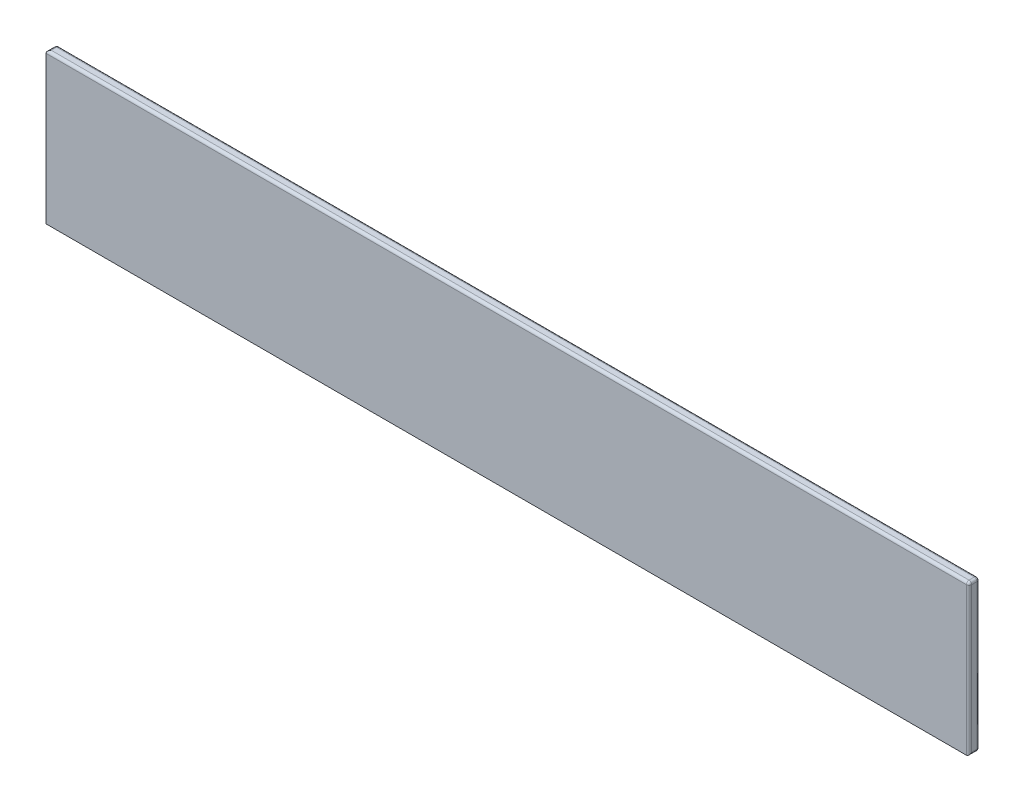
ISO-10303-21;
HEADER;
FILE_DESCRIPTION(('STEP AP214'),'2;1');
FILE_NAME('part.step','',(''),(''),'','','');
FILE_SCHEMA(('AUTOMOTIVE_DESIGN { 1 0 10303 214 1 1 1 1 }'));
ENDSEC;
DATA;
#1=APPLICATION_CONTEXT('core data for automotive mechanical design processes');
#2=APPLICATION_PROTOCOL_DEFINITION('international standard','automotive_design',2000,#1);
#3=PRODUCT_CONTEXT('',#1,'mechanical');
#4=PRODUCT('Part','Part','',(#3));
#5=PRODUCT_RELATED_PRODUCT_CATEGORY('part','',(#4));
#6=PRODUCT_DEFINITION_FORMATION('','',#4);
#7=PRODUCT_DEFINITION_CONTEXT('part definition',#1,'design');
#8=PRODUCT_DEFINITION('design','',#6,#7);
#9=PRODUCT_DEFINITION_SHAPE('','',#8);
#10=(LENGTH_UNIT() NAMED_UNIT(*) SI_UNIT(.MILLI.,.METRE.));
#11=(NAMED_UNIT(*) PLANE_ANGLE_UNIT() SI_UNIT($,.RADIAN.));
#12=(NAMED_UNIT(*) SI_UNIT($,.STERADIAN.) SOLID_ANGLE_UNIT());
#13=UNCERTAINTY_MEASURE_WITH_UNIT(LENGTH_MEASURE(1.E-05),#10,'distance_accuracy_value','');
#14=(GEOMETRIC_REPRESENTATION_CONTEXT(3) GLOBAL_UNCERTAINTY_ASSIGNED_CONTEXT((#13)) GLOBAL_UNIT_ASSIGNED_CONTEXT((#10,
#11,#12)) REPRESENTATION_CONTEXT('',''));
#15=CARTESIAN_POINT('',(0.,0.,0.));
#16=DIRECTION('',(0.,0.,1.));
#17=DIRECTION('',(1.,0.,0.));
#18=AXIS2_PLACEMENT_3D('',#15,#16,#17);
#19=CARTESIAN_POINT('',(875.,142.5,20.));
#20=DIRECTION('',(-1.,0.,0.));
#21=DIRECTION('',(0.,0.,1.));
#22=AXIS2_PLACEMENT_3D('',#19,#20,#21);
#23=PLANE('',#22);
#24=DIRECTION('',(0.,1.,0.));
#25=VECTOR('',#24,1.);
#26=CARTESIAN_POINT('',(875.,-142.5,15.));
#27=LINE('',#26,#25);
#28=CARTESIAN_POINT('',(875.,137.5,15.));
#29=VERTEX_POINT('',#28);
#30=CARTESIAN_POINT('',(875.,-137.5,15.));
#31=VERTEX_POINT('',#30);
#32=EDGE_CURVE('E127',#29,#31,#27,.F.);
#33=ORIENTED_EDGE('',*,*,#32,.T.);
#34=DIRECTION('',(0.,0.,-1.));
#35=VECTOR('',#34,1.);
#36=CARTESIAN_POINT('',(875.,-137.5,20.));
#37=LINE('',#36,#35);
#38=CARTESIAN_POINT('',(875.,-137.5,5.));
#39=VERTEX_POINT('',#38);
#40=EDGE_CURVE('E132',#31,#39,#37,.T.);
#41=ORIENTED_EDGE('',*,*,#40,.T.);
#42=DIRECTION('',(0.,1.,0.));
#43=VECTOR('',#42,1.);
#44=CARTESIAN_POINT('',(875.,142.5,5.));
#45=LINE('',#44,#43);
#46=CARTESIAN_POINT('',(875.,137.5,5.));
#47=VERTEX_POINT('',#46);
#48=EDGE_CURVE('E129',#39,#47,#45,.T.);
#49=ORIENTED_EDGE('',*,*,#48,.T.);
#50=DIRECTION('',(0.,0.,-1.));
#51=VECTOR('',#50,1.);
#52=CARTESIAN_POINT('',(875.,137.5,20.));
#53=LINE('',#52,#51);
#54=EDGE_CURVE('E120',#47,#29,#53,.F.);
#55=ORIENTED_EDGE('',*,*,#54,.T.);
#56=EDGE_LOOP('',(#33,#41,#49,#55));
#57=FACE_BOUND('',#56,.T.);
#58=ADVANCED_FACE('F34',(#57),#23,.F.);
#59=CARTESIAN_POINT('',(-875.,142.5,20.));
#60=DIRECTION('',(0.,-1.,0.));
#61=DIRECTION('',(0.,0.,-1.));
#62=AXIS2_PLACEMENT_3D('',#59,#60,#61);
#63=PLANE('',#62);
#64=DIRECTION('',(-1.,0.,0.));
#65=VECTOR('',#64,1.);
#66=CARTESIAN_POINT('',(-875.,142.5,5.));
#67=LINE('',#66,#65);
#68=CARTESIAN_POINT('',(870.,142.5,5.));
#69=VERTEX_POINT('',#68);
#70=CARTESIAN_POINT('',(-870.,142.5,5.));
#71=VERTEX_POINT('',#70);
#72=EDGE_CURVE('E147',#69,#71,#67,.T.);
#73=ORIENTED_EDGE('',*,*,#72,.T.);
#74=DIRECTION('',(0.,0.,-1.));
#75=VECTOR('',#74,1.);
#76=CARTESIAN_POINT('',(-870.,142.5,20.));
#77=LINE('',#76,#75);
#78=CARTESIAN_POINT('',(-870.,142.5,15.));
#79=VERTEX_POINT('',#78);
#80=EDGE_CURVE('E150',#71,#79,#77,.F.);
#81=ORIENTED_EDGE('',*,*,#80,.T.);
#82=DIRECTION('',(-1.,0.,0.));
#83=VECTOR('',#82,1.);
#84=CARTESIAN_POINT('',(875.,142.5,15.));
#85=LINE('',#84,#83);
#86=CARTESIAN_POINT('',(870.,142.5,15.));
#87=VERTEX_POINT('',#86);
#88=EDGE_CURVE('E145',#79,#87,#85,.F.);
#89=ORIENTED_EDGE('',*,*,#88,.T.);
#90=DIRECTION('',(0.,0.,-1.));
#91=VECTOR('',#90,1.);
#92=CARTESIAN_POINT('',(870.,142.5,20.));
#93=LINE('',#92,#91);
#94=EDGE_CURVE('E143',#87,#69,#93,.T.);
#95=ORIENTED_EDGE('',*,*,#94,.T.);
#96=EDGE_LOOP('',(#73,#81,#89,#95));
#97=FACE_BOUND('',#96,.T.);
#98=ADVANCED_FACE('F208',(#97),#63,.F.);
#99=CARTESIAN_POINT('',(-875.,142.5,20.));
#100=DIRECTION('',(1.,0.,0.));
#101=DIRECTION('',(0.,0.,-1.));
#102=AXIS2_PLACEMENT_3D('',#99,#100,#101);
#103=PLANE('',#102);
#104=DIRECTION('',(0.,0.,-1.));
#105=VECTOR('',#104,1.);
#106=CARTESIAN_POINT('',(-875.,137.5,20.));
#107=LINE('',#106,#105);
#108=CARTESIAN_POINT('',(-875.,137.5,20.));
#109=VERTEX_POINT('',#108);
#110=CARTESIAN_POINT('',(-875.,137.5,5.));
#111=VERTEX_POINT('',#110);
#112=EDGE_CURVE('E152',#109,#111,#107,.T.);
#113=ORIENTED_EDGE('',*,*,#112,.T.);
#114=DIRECTION('',(0.,-1.,0.));
#115=VECTOR('',#114,1.);
#116=CARTESIAN_POINT('',(-875.,142.5,5.));
#117=LINE('',#116,#115);
#118=CARTESIAN_POINT('',(-875.,-142.5,5.));
#119=VERTEX_POINT('',#118);
#120=EDGE_CURVE('E119',#111,#119,#117,.T.);
#121=ORIENTED_EDGE('',*,*,#120,.T.);
#122=DIRECTION('',(0.,0.,-1.));
#123=VECTOR('',#122,1.);
#124=CARTESIAN_POINT('',(-875.,-142.5,20.));
#125=LINE('',#124,#123);
#126=CARTESIAN_POINT('',(-875.,-142.5,20.));
#127=VERTEX_POINT('',#126);
#128=EDGE_CURVE('E116',#127,#119,#125,.T.);
#129=ORIENTED_EDGE('',*,*,#128,.F.);
#130=DIRECTION('',(0.,-1.,0.));
#131=VECTOR('',#130,1.);
#132=CARTESIAN_POINT('',(-875.,142.5,20.));
#133=LINE('',#132,#131);
#134=EDGE_CURVE('E107',#109,#127,#133,.T.);
#135=ORIENTED_EDGE('',*,*,#134,.F.);
#136=EDGE_LOOP('',(#113,#121,#129,#135));
#137=FACE_BOUND('',#136,.T.);
#138=ADVANCED_FACE('F117',(#137),#103,.F.);
#139=CARTESIAN_POINT('',(-875.,-142.5,20.));
#140=DIRECTION('',(0.,1.,0.));
#141=DIRECTION('',(0.,0.,1.));
#142=AXIS2_PLACEMENT_3D('',#139,#140,#141);
#143=PLANE('',#142);
#144=ORIENTED_EDGE('',*,*,#128,.T.);
#145=DIRECTION('',(1.,0.,0.));
#146=VECTOR('',#145,1.);
#147=CARTESIAN_POINT('',(-875.,-142.5,5.));
#148=LINE('',#147,#146);
#149=CARTESIAN_POINT('',(870.,-142.5,5.));
#150=VERTEX_POINT('',#149);
#151=EDGE_CURVE('E57',#119,#150,#148,.T.);
#152=ORIENTED_EDGE('',*,*,#151,.T.);
#153=DIRECTION('',(0.,0.,-1.));
#154=VECTOR('',#153,1.);
#155=CARTESIAN_POINT('',(870.,-142.5,20.));
#156=LINE('',#155,#154);
#157=CARTESIAN_POINT('',(870.,-142.5,20.));
#158=VERTEX_POINT('',#157);
#159=EDGE_CURVE('E123',#150,#158,#156,.F.);
#160=ORIENTED_EDGE('',*,*,#159,.T.);
#161=DIRECTION('',(1.,0.,0.));
#162=VECTOR('',#161,1.);
#163=CARTESIAN_POINT('',(-875.,-142.5,20.));
#164=LINE('',#163,#162);
#165=EDGE_CURVE('E111',#127,#158,#164,.T.);
#166=ORIENTED_EDGE('',*,*,#165,.F.);
#167=EDGE_LOOP('',(#144,#152,#160,#166));
#168=FACE_BOUND('',#167,.T.);
#169=ADVANCED_FACE('F122',(#168),#143,.F.);
#170=CARTESIAN_POINT('',(0.,0.,20.));
#171=DIRECTION('',(0.,0.,1.));
#172=DIRECTION('',(1.,0.,0.));
#173=AXIS2_PLACEMENT_3D('',#170,#171,#172);
#174=PLANE('',#173);
#175=ORIENTED_EDGE('',*,*,#165,.T.);
#176=DIRECTION('',(0.,1.,0.));
#177=VECTOR('',#176,1.);
#178=CARTESIAN_POINT('',(870.,142.5,20.));
#179=LINE('',#178,#177);
#180=CARTESIAN_POINT('',(870.,137.5,20.));
#181=VERTEX_POINT('',#180);
#182=EDGE_CURVE('E11',#158,#181,#179,.T.);
#183=ORIENTED_EDGE('',*,*,#182,.T.);
#184=DIRECTION('',(-1.,0.,0.));
#185=VECTOR('',#184,1.);
#186=CARTESIAN_POINT('',(-875.,137.5,20.));
#187=LINE('',#186,#185);
#188=EDGE_CURVE('E43',#181,#109,#187,.T.);
#189=ORIENTED_EDGE('',*,*,#188,.T.);
#190=ORIENTED_EDGE('',*,*,#134,.T.);
#191=EDGE_LOOP('',(#175,#183,#189,#190));
#192=FACE_BOUND('',#191,.T.);
#193=ADVANCED_FACE('F109',(#192),#174,.T.);
#194=CARTESIAN_POINT('',(0.,0.,0.));
#195=DIRECTION('',(0.,0.,1.));
#196=DIRECTION('',(1.,0.,0.));
#197=AXIS2_PLACEMENT_3D('',#194,#195,#196);
#198=PLANE('',#197);
#199=DIRECTION('',(-1.,0.,0.));
#200=VECTOR('',#199,1.);
#201=CARTESIAN_POINT('',(0.,137.5,0.));
#202=LINE('',#201,#200);
#203=CARTESIAN_POINT('',(-870.,137.5,0.));
#204=VERTEX_POINT('',#203);
#205=CARTESIAN_POINT('',(870.,137.5,0.));
#206=VERTEX_POINT('',#205);
#207=EDGE_CURVE('E138',#204,#206,#202,.F.);
#208=ORIENTED_EDGE('',*,*,#207,.T.);
#209=DIRECTION('',(0.,1.,0.));
#210=VECTOR('',#209,1.);
#211=CARTESIAN_POINT('',(870.,0.,0.));
#212=LINE('',#211,#210);
#213=CARTESIAN_POINT('',(870.,-137.5,0.));
#214=VERTEX_POINT('',#213);
#215=EDGE_CURVE('E140',#206,#214,#212,.F.);
#216=ORIENTED_EDGE('',*,*,#215,.T.);
#217=DIRECTION('',(1.,0.,0.));
#218=VECTOR('',#217,1.);
#219=CARTESIAN_POINT('',(0.,-137.5,0.));
#220=LINE('',#219,#218);
#221=CARTESIAN_POINT('',(-870.,-137.5,0.));
#222=VERTEX_POINT('',#221);
#223=EDGE_CURVE('E134',#214,#222,#220,.F.);
#224=ORIENTED_EDGE('',*,*,#223,.T.);
#225=DIRECTION('',(0.,-1.,0.));
#226=VECTOR('',#225,1.);
#227=CARTESIAN_POINT('',(-870.,0.,0.));
#228=LINE('',#227,#226);
#229=EDGE_CURVE('E136',#222,#204,#228,.F.);
#230=ORIENTED_EDGE('',*,*,#229,.T.);
#231=EDGE_LOOP('',(#208,#216,#224,#230));
#232=FACE_BOUND('',#231,.T.);
#233=ADVANCED_FACE('F229',(#232),#198,.F.);
#234=CARTESIAN_POINT('',(0.,137.5,15.));
#235=DIRECTION('',(1.,0.,0.));
#236=DIRECTION('',(0.,0.,-1.));
#237=AXIS2_PLACEMENT_3D('',#234,#235,#236);
#238=CYLINDRICAL_SURFACE('',#237,5.);
#239=CARTESIAN_POINT('',(870.,137.5,15.));
#240=DIRECTION('',(1.,0.,0.));
#241=DIRECTION('',(0.,0.,-1.));
#242=AXIS2_PLACEMENT_3D('',#239,#240,#241);
#243=CIRCLE('',#242,5.);
#244=EDGE_CURVE('E191',#87,#181,#243,.T.);
#245=ORIENTED_EDGE('',*,*,#244,.F.);
#246=ORIENTED_EDGE('',*,*,#88,.F.);
#247=CARTESIAN_POINT('',(-870.,137.5,15.));
#248=DIRECTION('',(-0.707106781186547,0.,-0.707106781186547));
#249=DIRECTION('',(0.707106781186547,0.,-0.707106781186547));
#250=AXIS2_PLACEMENT_3D('',#247,#248,#249);
#251=ELLIPSE('',#250,7.07106781186547,5.);
#252=EDGE_CURVE('E38',#109,#79,#251,.T.);
#253=ORIENTED_EDGE('',*,*,#252,.F.);
#254=ORIENTED_EDGE('',*,*,#188,.F.);
#255=EDGE_LOOP('',(#245,#246,#253,#254));
#256=FACE_BOUND('',#255,.T.);
#257=ADVANCED_FACE('F36',(#256),#238,.T.);
#258=CARTESIAN_POINT('',(-870.,137.5,20.));
#259=DIRECTION('',(0.,0.,-1.));
#260=DIRECTION('',(-1.,0.,0.));
#261=AXIS2_PLACEMENT_3D('',#258,#259,#260);
#262=CYLINDRICAL_SURFACE('',#261,5.);
#263=ORIENTED_EDGE('',*,*,#252,.T.);
#264=ORIENTED_EDGE('',*,*,#80,.F.);
#265=CARTESIAN_POINT('',(-870.,137.5,5.));
#266=DIRECTION('',(0.,0.,-1.));
#267=DIRECTION('',(-1.,0.,0.));
#268=AXIS2_PLACEMENT_3D('',#265,#266,#267);
#269=CIRCLE('',#268,5.);
#270=EDGE_CURVE('E188',#111,#71,#269,.T.);
#271=ORIENTED_EDGE('',*,*,#270,.F.);
#272=ORIENTED_EDGE('',*,*,#112,.F.);
#273=EDGE_LOOP('',(#263,#264,#271,#272));
#274=FACE_BOUND('',#273,.T.);
#275=ADVANCED_FACE('F202',(#274),#262,.T.);
#276=CARTESIAN_POINT('',(-870.,142.5,5.));
#277=DIRECTION('',(0.,-1.,0.));
#278=DIRECTION('',(0.,0.,-1.));
#279=AXIS2_PLACEMENT_3D('',#276,#277,#278);
#280=CYLINDRICAL_SURFACE('',#279,5.);
#281=CARTESIAN_POINT('',(-870.,-137.5,5.));
#282=DIRECTION('',(0.707106781186547,-0.707106781186547,0.));
#283=DIRECTION('',(0.707106781186547,0.707106781186547,0.));
#284=AXIS2_PLACEMENT_3D('',#281,#282,#283);
#285=ELLIPSE('',#284,7.07106781186547,5.);
#286=EDGE_CURVE('E182',#119,#222,#285,.T.);
#287=ORIENTED_EDGE('',*,*,#286,.F.);
#288=ORIENTED_EDGE('',*,*,#120,.F.);
#289=CARTESIAN_POINT('',(-870.,137.5,5.));
#290=DIRECTION('',(0.,1.,0.));
#291=DIRECTION('',(0.,0.,1.));
#292=AXIS2_PLACEMENT_3D('',#289,#290,#291);
#293=CIRCLE('',#292,5.);
#294=EDGE_CURVE('E185',#204,#111,#293,.T.);
#295=ORIENTED_EDGE('',*,*,#294,.F.);
#296=ORIENTED_EDGE('',*,*,#229,.F.);
#297=EDGE_LOOP('',(#287,#288,#295,#296));
#298=FACE_BOUND('',#297,.T.);
#299=ADVANCED_FACE('F235',(#298),#280,.T.);
#300=CARTESIAN_POINT('',(870.,0.,15.));
#301=DIRECTION('',(0.,-1.,0.));
#302=DIRECTION('',(0.,0.,-1.));
#303=AXIS2_PLACEMENT_3D('',#300,#301,#302);
#304=CYLINDRICAL_SURFACE('',#303,5.);
#305=CARTESIAN_POINT('',(870.,137.5,15.));
#306=DIRECTION('',(0.,1.,0.));
#307=DIRECTION('',(0.,0.,1.));
#308=AXIS2_PLACEMENT_3D('',#305,#306,#307);
#309=CIRCLE('',#308,5.);
#310=EDGE_CURVE('E193',#181,#29,#309,.T.);
#311=ORIENTED_EDGE('',*,*,#310,.F.);
#312=ORIENTED_EDGE('',*,*,#182,.F.);
#313=CARTESIAN_POINT('',(870.,-137.5,15.));
#314=DIRECTION('',(0.,-0.707106781186547,-0.707106781186547));
#315=DIRECTION('',(0.,0.707106781186547,-0.707106781186547));
#316=AXIS2_PLACEMENT_3D('',#313,#314,#315);
#317=ELLIPSE('',#316,7.07106781186547,5.);
#318=EDGE_CURVE('E179',#31,#158,#317,.T.);
#319=ORIENTED_EDGE('',*,*,#318,.F.);
#320=ORIENTED_EDGE('',*,*,#32,.F.);
#321=EDGE_LOOP('',(#311,#312,#319,#320));
#322=FACE_BOUND('',#321,.T.);
#323=ADVANCED_FACE('F249',(#322),#304,.T.);
#324=CARTESIAN_POINT('',(870.,137.5,15.));
#325=DIRECTION('',(0.,0.,1.));
#326=DIRECTION('',(1.,0.,0.));
#327=AXIS2_PLACEMENT_3D('',#324,#325,#326);
#328=SPHERICAL_SURFACE('',#327,5.);
#329=ORIENTED_EDGE('',*,*,#244,.T.);
#330=ORIENTED_EDGE('',*,*,#310,.T.);
#331=CARTESIAN_POINT('',(870.,137.5,15.));
#332=DIRECTION('',(0.,0.,1.));
#333=DIRECTION('',(1.,0.,0.));
#334=AXIS2_PLACEMENT_3D('',#331,#332,#333);
#335=CIRCLE('',#334,5.);
#336=EDGE_CURVE('E176',#87,#29,#335,.F.);
#337=ORIENTED_EDGE('',*,*,#336,.F.);
#338=EDGE_LOOP('',(#329,#330,#337));
#339=FACE_BOUND('',#338,.T.);
#340=ADVANCED_FACE('F240',(#339),#328,.T.);
#341=CARTESIAN_POINT('',(-870.,137.5,5.));
#342=DIRECTION('',(-1.,0.,0.));
#343=DIRECTION('',(0.,0.,1.));
#344=AXIS2_PLACEMENT_3D('',#341,#342,#343);
#345=SPHERICAL_SURFACE('',#344,5.);
#346=ORIENTED_EDGE('',*,*,#294,.T.);
#347=ORIENTED_EDGE('',*,*,#270,.T.);
#348=CARTESIAN_POINT('',(-870.,137.5,5.));
#349=DIRECTION('',(-1.,0.,0.));
#350=DIRECTION('',(0.,0.,1.));
#351=AXIS2_PLACEMENT_3D('',#348,#349,#350);
#352=CIRCLE('',#351,5.);
#353=EDGE_CURVE('E174',#204,#71,#352,.F.);
#354=ORIENTED_EDGE('',*,*,#353,.F.);
#355=EDGE_LOOP('',(#346,#347,#354));
#356=FACE_BOUND('',#355,.T.);
#357=ADVANCED_FACE('F237',(#356),#345,.T.);
#358=CARTESIAN_POINT('',(-875.,-137.5,5.));
#359=DIRECTION('',(1.,0.,0.));
#360=DIRECTION('',(0.,0.,-1.));
#361=AXIS2_PLACEMENT_3D('',#358,#359,#360);
#362=CYLINDRICAL_SURFACE('',#361,5.);
#363=ORIENTED_EDGE('',*,*,#286,.T.);
#364=ORIENTED_EDGE('',*,*,#223,.F.);
#365=CARTESIAN_POINT('',(870.,-137.5,5.));
#366=DIRECTION('',(1.,0.,0.));
#367=DIRECTION('',(0.,0.,-1.));
#368=AXIS2_PLACEMENT_3D('',#365,#366,#367);
#369=CIRCLE('',#368,5.);
#370=EDGE_CURVE('E171',#150,#214,#369,.T.);
#371=ORIENTED_EDGE('',*,*,#370,.F.);
#372=ORIENTED_EDGE('',*,*,#151,.F.);
#373=EDGE_LOOP('',(#363,#364,#371,#372));
#374=FACE_BOUND('',#373,.T.);
#375=ADVANCED_FACE('F239',(#374),#362,.T.);
#376=CARTESIAN_POINT('',(870.,-137.5,20.));
#377=DIRECTION('',(0.,0.,-1.));
#378=DIRECTION('',(-1.,0.,0.));
#379=AXIS2_PLACEMENT_3D('',#376,#377,#378);
#380=CYLINDRICAL_SURFACE('',#379,5.);
#381=ORIENTED_EDGE('',*,*,#318,.T.);
#382=ORIENTED_EDGE('',*,*,#159,.F.);
#383=CARTESIAN_POINT('',(870.,-137.5,5.));
#384=DIRECTION('',(0.,0.,-1.));
#385=DIRECTION('',(-1.,0.,0.));
#386=AXIS2_PLACEMENT_3D('',#383,#384,#385);
#387=CIRCLE('',#386,5.);
#388=EDGE_CURVE('E168',#39,#150,#387,.T.);
#389=ORIENTED_EDGE('',*,*,#388,.F.);
#390=ORIENTED_EDGE('',*,*,#40,.F.);
#391=EDGE_LOOP('',(#381,#382,#389,#390));
#392=FACE_BOUND('',#391,.T.);
#393=ADVANCED_FACE('F246',(#392),#380,.T.);
#394=CARTESIAN_POINT('',(870.,137.5,20.));
#395=DIRECTION('',(0.,0.,-1.));
#396=DIRECTION('',(-1.,0.,0.));
#397=AXIS2_PLACEMENT_3D('',#394,#395,#396);
#398=CYLINDRICAL_SURFACE('',#397,5.);
#399=ORIENTED_EDGE('',*,*,#336,.T.);
#400=ORIENTED_EDGE('',*,*,#54,.F.);
#401=CARTESIAN_POINT('',(870.,137.5,5.));
#402=DIRECTION('',(0.,0.,-1.));
#403=DIRECTION('',(-1.,0.,0.));
#404=AXIS2_PLACEMENT_3D('',#401,#402,#403);
#405=CIRCLE('',#404,5.);
#406=EDGE_CURVE('E165',#69,#47,#405,.T.);
#407=ORIENTED_EDGE('',*,*,#406,.F.);
#408=ORIENTED_EDGE('',*,*,#94,.F.);
#409=EDGE_LOOP('',(#399,#400,#407,#408));
#410=FACE_BOUND('',#409,.T.);
#411=ADVANCED_FACE('F220',(#410),#398,.T.);
#412=CARTESIAN_POINT('',(-875.,137.5,5.));
#413=DIRECTION('',(-1.,0.,0.));
#414=DIRECTION('',(0.,0.,1.));
#415=AXIS2_PLACEMENT_3D('',#412,#413,#414);
#416=CYLINDRICAL_SURFACE('',#415,5.);
#417=ORIENTED_EDGE('',*,*,#353,.T.);
#418=ORIENTED_EDGE('',*,*,#72,.F.);
#419=CARTESIAN_POINT('',(870.,137.5,5.));
#420=DIRECTION('',(1.,0.,0.));
#421=DIRECTION('',(0.,1.,0.));
#422=AXIS2_PLACEMENT_3D('',#419,#420,#421);
#423=CIRCLE('',#422,5.);
#424=EDGE_CURVE('E162',#206,#69,#423,.T.);
#425=ORIENTED_EDGE('',*,*,#424,.F.);
#426=ORIENTED_EDGE('',*,*,#207,.F.);
#427=EDGE_LOOP('',(#417,#418,#425,#426));
#428=FACE_BOUND('',#427,.T.);
#429=ADVANCED_FACE('F214',(#428),#416,.T.);
#430=CARTESIAN_POINT('',(870.,-137.5,5.));
#431=DIRECTION('',(0.,-1.,0.));
#432=DIRECTION('',(0.,0.,-1.));
#433=AXIS2_PLACEMENT_3D('',#430,#431,#432);
#434=SPHERICAL_SURFACE('',#433,5.);
#435=ORIENTED_EDGE('',*,*,#388,.T.);
#436=ORIENTED_EDGE('',*,*,#370,.T.);
#437=CARTESIAN_POINT('',(870.,-137.5,5.));
#438=DIRECTION('',(0.,-1.,0.));
#439=DIRECTION('',(0.,0.,-1.));
#440=AXIS2_PLACEMENT_3D('',#437,#438,#439);
#441=CIRCLE('',#440,5.);
#442=EDGE_CURVE('E160',#39,#214,#441,.F.);
#443=ORIENTED_EDGE('',*,*,#442,.F.);
#444=EDGE_LOOP('',(#435,#436,#443));
#445=FACE_BOUND('',#444,.T.);
#446=ADVANCED_FACE('F264',(#445),#434,.T.);
#447=CARTESIAN_POINT('',(870.,137.5,5.));
#448=DIRECTION('',(0.,1.,0.));
#449=DIRECTION('',(-1.,0.,0.));
#450=AXIS2_PLACEMENT_3D('',#447,#448,#449);
#451=SPHERICAL_SURFACE('',#450,5.);
#452=ORIENTED_EDGE('',*,*,#424,.T.);
#453=ORIENTED_EDGE('',*,*,#406,.T.);
#454=CARTESIAN_POINT('',(870.,137.5,5.));
#455=DIRECTION('',(0.,1.,0.));
#456=DIRECTION('',(0.,0.,1.));
#457=AXIS2_PLACEMENT_3D('',#454,#455,#456);
#458=CIRCLE('',#457,5.);
#459=EDGE_CURVE('E158',#206,#47,#458,.F.);
#460=ORIENTED_EDGE('',*,*,#459,.F.);
#461=EDGE_LOOP('',(#452,#453,#460));
#462=FACE_BOUND('',#461,.T.);
#463=ADVANCED_FACE('F223',(#462),#451,.T.);
#464=CARTESIAN_POINT('',(870.,142.5,5.));
#465=DIRECTION('',(0.,1.,0.));
#466=DIRECTION('',(0.,0.,1.));
#467=AXIS2_PLACEMENT_3D('',#464,#465,#466);
#468=CYLINDRICAL_SURFACE('',#467,5.);
#469=ORIENTED_EDGE('',*,*,#442,.T.);
#470=ORIENTED_EDGE('',*,*,#215,.F.);
#471=ORIENTED_EDGE('',*,*,#459,.T.);
#472=ORIENTED_EDGE('',*,*,#48,.F.);
#473=EDGE_LOOP('',(#469,#470,#471,#472));
#474=FACE_BOUND('',#473,.T.);
#475=ADVANCED_FACE('F226',(#474),#468,.T.);
#476=CLOSED_SHELL('',(#58,#98,#138,#169,#193,#233,#257,#275,#299,#323,#340,#357,#375,#393,#411,
#429,#446,#463,#475));
#477=MANIFOLD_SOLID_BREP('B2',#476);
#478=ADVANCED_BREP_SHAPE_REPRESENTATION('',(#18,#477),#14);
#479=SHAPE_DEFINITION_REPRESENTATION(#9,#478);
ENDSEC;
END-ISO-10303-21;
